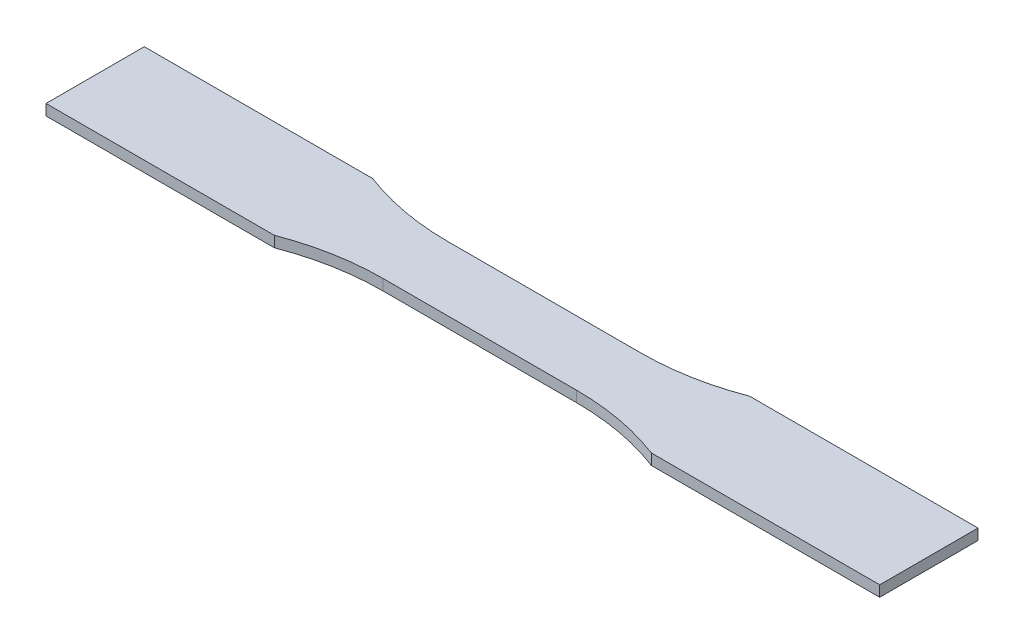
ISO-10303-21;
HEADER;
FILE_DESCRIPTION(('STEP AP214'),'2;1');
FILE_NAME('part.step','',(''),(''),'','','');
FILE_SCHEMA(('AUTOMOTIVE_DESIGN { 1 0 10303 214 1 1 1 1 }'));
ENDSEC;
DATA;
#1=APPLICATION_CONTEXT('core data for automotive mechanical design processes');
#2=APPLICATION_PROTOCOL_DEFINITION('international standard','automotive_design',2000,#1);
#3=PRODUCT_CONTEXT('',#1,'mechanical');
#4=PRODUCT('Part','Part','',(#3));
#5=PRODUCT_RELATED_PRODUCT_CATEGORY('part','',(#4));
#6=PRODUCT_DEFINITION_FORMATION('','',#4);
#7=PRODUCT_DEFINITION_CONTEXT('part definition',#1,'design');
#8=PRODUCT_DEFINITION('design','',#6,#7);
#9=PRODUCT_DEFINITION_SHAPE('','',#8);
#10=(LENGTH_UNIT() NAMED_UNIT(*) SI_UNIT(.MILLI.,.METRE.));
#11=(NAMED_UNIT(*) PLANE_ANGLE_UNIT() SI_UNIT($,.RADIAN.));
#12=(NAMED_UNIT(*) SI_UNIT($,.STERADIAN.) SOLID_ANGLE_UNIT());
#13=UNCERTAINTY_MEASURE_WITH_UNIT(LENGTH_MEASURE(1.E-05),#10,'distance_accuracy_value','');
#14=(GEOMETRIC_REPRESENTATION_CONTEXT(3) GLOBAL_UNCERTAINTY_ASSIGNED_CONTEXT((#13)) GLOBAL_UNIT_ASSIGNED_CONTEXT((#10,
#11,#12)) REPRESENTATION_CONTEXT('',''));
#15=CARTESIAN_POINT('',(0.,0.,0.));
#16=DIRECTION('',(0.,0.,1.));
#17=DIRECTION('',(1.,0.,0.));
#18=AXIS2_PLACEMENT_3D('',#15,#16,#17);
#19=CARTESIAN_POINT('',(-28.4999999999999,1.6,85.5));
#20=DIRECTION('',(0.,-1.,0.));
#21=DIRECTION('',(0.,0.,-1.));
#22=AXIS2_PLACEMENT_3D('',#19,#20,#21);
#23=CYLINDRICAL_SURFACE('',#22,76.);
#24=CARTESIAN_POINT('',(-28.4999999999999,-1.6,85.5));
#25=DIRECTION('',(0.,1.,0.));
#26=DIRECTION('',(0.,0.,1.));
#27=AXIS2_PLACEMENT_3D('',#24,#25,#26);
#28=CIRCLE('',#27,76.);
#29=CARTESIAN_POINT('',(-28.4999999999999,-1.6,9.49999999999999));
#30=VERTEX_POINT('',#29);
#31=CARTESIAN_POINT('',(-55.6108834234518,-1.6,14.5));
#32=VERTEX_POINT('',#31);
#33=EDGE_CURVE('E154',#30,#32,#28,.T.);
#34=ORIENTED_EDGE('',*,*,#33,.F.);
#35=DIRECTION('',(0.,-1.,0.));
#36=VECTOR('',#35,1.);
#37=CARTESIAN_POINT('',(-28.4999999999999,1.6,9.49999999999999));
#38=LINE('',#37,#36);
#39=CARTESIAN_POINT('',(-28.4999999999999,1.6,9.49999999999999));
#40=VERTEX_POINT('',#39);
#41=EDGE_CURVE('E11',#40,#30,#38,.T.);
#42=ORIENTED_EDGE('',*,*,#41,.F.);
#43=CARTESIAN_POINT('',(-28.4999999999999,1.6,85.5));
#44=DIRECTION('',(0.,1.,0.));
#45=DIRECTION('',(0.,0.,1.));
#46=AXIS2_PLACEMENT_3D('',#43,#44,#45);
#47=CIRCLE('',#46,76.);
#48=CARTESIAN_POINT('',(-55.6108834234518,1.6,14.5));
#49=VERTEX_POINT('',#48);
#50=EDGE_CURVE('E185',#40,#49,#47,.T.);
#51=ORIENTED_EDGE('',*,*,#50,.T.);
#52=DIRECTION('',(0.,-1.,0.));
#53=VECTOR('',#52,1.);
#54=CARTESIAN_POINT('',(-55.6108834234518,1.6,14.5));
#55=LINE('',#54,#53);
#56=EDGE_CURVE('E54',#49,#32,#55,.T.);
#57=ORIENTED_EDGE('',*,*,#56,.T.);
#58=EDGE_LOOP('',(#34,#42,#51,#57));
#59=FACE_BOUND('',#58,.T.);
#60=ADVANCED_FACE('F38',(#59),#23,.F.);
#61=CARTESIAN_POINT('',(0.,1.6,9.49999999999999));
#62=DIRECTION('',(0.,0.,1.));
#63=DIRECTION('',(1.,0.,0.));
#64=AXIS2_PLACEMENT_3D('',#61,#62,#63);
#65=PLANE('',#64);
#66=DIRECTION('',(-1.,0.,0.));
#67=VECTOR('',#66,1.);
#68=CARTESIAN_POINT('',(0.,-1.6,9.49999999999999));
#69=LINE('',#68,#67);
#70=CARTESIAN_POINT('',(28.5000000000001,-1.6,9.49999999999999));
#71=VERTEX_POINT('',#70);
#72=EDGE_CURVE('E156',#71,#30,#69,.T.);
#73=ORIENTED_EDGE('',*,*,#72,.F.);
#74=DIRECTION('',(0.,-1.,0.));
#75=VECTOR('',#74,1.);
#76=CARTESIAN_POINT('',(28.5000000000001,1.6,9.49999999999999));
#77=LINE('',#76,#75);
#78=CARTESIAN_POINT('',(28.5000000000001,1.6,9.49999999999999));
#79=VERTEX_POINT('',#78);
#80=EDGE_CURVE('E46',#79,#71,#77,.T.);
#81=ORIENTED_EDGE('',*,*,#80,.F.);
#82=DIRECTION('',(-1.,0.,0.));
#83=VECTOR('',#82,1.);
#84=CARTESIAN_POINT('',(0.,1.6,9.49999999999999));
#85=LINE('',#84,#83);
#86=EDGE_CURVE('E223',#79,#40,#85,.T.);
#87=ORIENTED_EDGE('',*,*,#86,.T.);
#88=ORIENTED_EDGE('',*,*,#41,.T.);
#89=EDGE_LOOP('',(#73,#81,#87,#88));
#90=FACE_BOUND('',#89,.T.);
#91=ADVANCED_FACE('F211',(#90),#65,.T.);
#92=CARTESIAN_POINT('',(28.5000000000001,1.6,85.5));
#93=DIRECTION('',(0.,-1.,0.));
#94=DIRECTION('',(0.,0.,-1.));
#95=AXIS2_PLACEMENT_3D('',#92,#93,#94);
#96=CYLINDRICAL_SURFACE('',#95,76.);
#97=CARTESIAN_POINT('',(28.5000000000001,-1.6,85.5));
#98=DIRECTION('',(0.,1.,0.));
#99=DIRECTION('',(0.,0.,1.));
#100=AXIS2_PLACEMENT_3D('',#97,#98,#99);
#101=CIRCLE('',#100,76.);
#102=CARTESIAN_POINT('',(55.6108834234521,-1.6,14.5));
#103=VERTEX_POINT('',#102);
#104=EDGE_CURVE('E159',#103,#71,#101,.T.);
#105=ORIENTED_EDGE('',*,*,#104,.F.);
#106=DIRECTION('',(0.,-1.,0.));
#107=VECTOR('',#106,1.);
#108=CARTESIAN_POINT('',(55.6108834234521,1.6,14.5));
#109=LINE('',#108,#107);
#110=CARTESIAN_POINT('',(55.6108834234521,1.6,14.5));
#111=VERTEX_POINT('',#110);
#112=EDGE_CURVE('E200',#111,#103,#109,.T.);
#113=ORIENTED_EDGE('',*,*,#112,.F.);
#114=CARTESIAN_POINT('',(28.5000000000001,1.6,85.5));
#115=DIRECTION('',(0.,1.,0.));
#116=DIRECTION('',(0.,0.,1.));
#117=AXIS2_PLACEMENT_3D('',#114,#115,#116);
#118=CIRCLE('',#117,76.);
#119=EDGE_CURVE('E207',#111,#79,#118,.T.);
#120=ORIENTED_EDGE('',*,*,#119,.T.);
#121=ORIENTED_EDGE('',*,*,#80,.T.);
#122=EDGE_LOOP('',(#105,#113,#120,#121));
#123=FACE_BOUND('',#122,.T.);
#124=ADVANCED_FACE('F205',(#123),#96,.F.);
#125=CARTESIAN_POINT('',(0.,1.6,14.5));
#126=DIRECTION('',(0.,0.,1.));
#127=DIRECTION('',(1.,0.,0.));
#128=AXIS2_PLACEMENT_3D('',#125,#126,#127);
#129=PLANE('',#128);
#130=DIRECTION('',(-1.,0.,0.));
#131=VECTOR('',#130,1.);
#132=CARTESIAN_POINT('',(0.,-1.6,14.5));
#133=LINE('',#132,#131);
#134=CARTESIAN_POINT('',(123.,-1.6,14.5));
#135=VERTEX_POINT('',#134);
#136=EDGE_CURVE('E162',#135,#103,#133,.T.);
#137=ORIENTED_EDGE('',*,*,#136,.F.);
#138=DIRECTION('',(0.,-1.,0.));
#139=VECTOR('',#138,1.);
#140=CARTESIAN_POINT('',(123.,1.6,14.5));
#141=LINE('',#140,#139);
#142=CARTESIAN_POINT('',(123.,1.6,14.5));
#143=VERTEX_POINT('',#142);
#144=EDGE_CURVE('E198',#143,#135,#141,.T.);
#145=ORIENTED_EDGE('',*,*,#144,.F.);
#146=DIRECTION('',(-1.,0.,0.));
#147=VECTOR('',#146,1.);
#148=CARTESIAN_POINT('',(0.,1.6,14.5));
#149=LINE('',#148,#147);
#150=EDGE_CURVE('E222',#143,#111,#149,.T.);
#151=ORIENTED_EDGE('',*,*,#150,.T.);
#152=ORIENTED_EDGE('',*,*,#112,.T.);
#153=EDGE_LOOP('',(#137,#145,#151,#152));
#154=FACE_BOUND('',#153,.T.);
#155=ADVANCED_FACE('F218',(#154),#129,.T.);
#156=CARTESIAN_POINT('',(123.,1.6,0.));
#157=DIRECTION('',(-1.,0.,0.));
#158=DIRECTION('',(0.,0.,1.));
#159=AXIS2_PLACEMENT_3D('',#156,#157,#158);
#160=PLANE('',#159);
#161=DIRECTION('',(0.,0.,-1.));
#162=VECTOR('',#161,1.);
#163=CARTESIAN_POINT('',(123.,-1.6,0.));
#164=LINE('',#163,#162);
#165=CARTESIAN_POINT('',(123.,-1.6,-14.5));
#166=VERTEX_POINT('',#165);
#167=EDGE_CURVE('E165',#135,#166,#164,.T.);
#168=ORIENTED_EDGE('',*,*,#167,.T.);
#169=DIRECTION('',(0.,-1.,0.));
#170=VECTOR('',#169,1.);
#171=CARTESIAN_POINT('',(123.,1.6,-14.5));
#172=LINE('',#171,#170);
#173=CARTESIAN_POINT('',(123.,1.6,-14.5));
#174=VERTEX_POINT('',#173);
#175=EDGE_CURVE('E195',#174,#166,#172,.T.);
#176=ORIENTED_EDGE('',*,*,#175,.F.);
#177=DIRECTION('',(0.,0.,-1.));
#178=VECTOR('',#177,1.);
#179=CARTESIAN_POINT('',(123.,1.6,0.));
#180=LINE('',#179,#178);
#181=EDGE_CURVE('E225',#143,#174,#180,.T.);
#182=ORIENTED_EDGE('',*,*,#181,.F.);
#183=ORIENTED_EDGE('',*,*,#144,.T.);
#184=EDGE_LOOP('',(#168,#176,#182,#183));
#185=FACE_BOUND('',#184,.T.);
#186=ADVANCED_FACE('F263',(#185),#160,.F.);
#187=CARTESIAN_POINT('',(0.,1.6,-14.5));
#188=DIRECTION('',(0.,0.,1.));
#189=DIRECTION('',(1.,0.,0.));
#190=AXIS2_PLACEMENT_3D('',#187,#188,#189);
#191=PLANE('',#190);
#192=DIRECTION('',(-1.,0.,0.));
#193=VECTOR('',#192,1.);
#194=CARTESIAN_POINT('',(0.,-1.6,-14.5));
#195=LINE('',#194,#193);
#196=CARTESIAN_POINT('',(55.6108834234521,-1.6,-14.5));
#197=VERTEX_POINT('',#196);
#198=EDGE_CURVE('E167',#166,#197,#195,.T.);
#199=ORIENTED_EDGE('',*,*,#198,.T.);
#200=DIRECTION('',(0.,-1.,0.));
#201=VECTOR('',#200,1.);
#202=CARTESIAN_POINT('',(55.6108834234521,1.6,-14.5));
#203=LINE('',#202,#201);
#204=CARTESIAN_POINT('',(55.6108834234521,1.6,-14.5));
#205=VERTEX_POINT('',#204);
#206=EDGE_CURVE('E193',#205,#197,#203,.T.);
#207=ORIENTED_EDGE('',*,*,#206,.F.);
#208=DIRECTION('',(-1.,0.,0.));
#209=VECTOR('',#208,1.);
#210=CARTESIAN_POINT('',(0.,1.6,-14.5));
#211=LINE('',#210,#209);
#212=EDGE_CURVE('E231',#174,#205,#211,.T.);
#213=ORIENTED_EDGE('',*,*,#212,.F.);
#214=ORIENTED_EDGE('',*,*,#175,.T.);
#215=EDGE_LOOP('',(#199,#207,#213,#214));
#216=FACE_BOUND('',#215,.T.);
#217=ADVANCED_FACE('F266',(#216),#191,.F.);
#218=CARTESIAN_POINT('',(28.5000000000001,1.6,-85.5));
#219=DIRECTION('',(0.,-1.,0.));
#220=DIRECTION('',(0.,0.,-1.));
#221=AXIS2_PLACEMENT_3D('',#218,#219,#220);
#222=CYLINDRICAL_SURFACE('',#221,76.);
#223=CARTESIAN_POINT('',(28.5000000000001,-1.6,-85.5));
#224=DIRECTION('',(0.,1.,0.));
#225=DIRECTION('',(0.,0.,1.));
#226=AXIS2_PLACEMENT_3D('',#223,#224,#225);
#227=CIRCLE('',#226,76.);
#228=CARTESIAN_POINT('',(28.5000000000001,-1.6,-9.50000000000001));
#229=VERTEX_POINT('',#228);
#230=EDGE_CURVE('E170',#229,#197,#227,.T.);
#231=ORIENTED_EDGE('',*,*,#230,.F.);
#232=DIRECTION('',(0.,-1.,0.));
#233=VECTOR('',#232,1.);
#234=CARTESIAN_POINT('',(28.5000000000001,1.6,-9.50000000000001));
#235=LINE('',#234,#233);
#236=CARTESIAN_POINT('',(28.5000000000001,1.6,-9.50000000000001));
#237=VERTEX_POINT('',#236);
#238=EDGE_CURVE('E191',#237,#229,#235,.T.);
#239=ORIENTED_EDGE('',*,*,#238,.F.);
#240=CARTESIAN_POINT('',(28.5000000000001,1.6,-85.5));
#241=DIRECTION('',(0.,1.,0.));
#242=DIRECTION('',(0.,0.,1.));
#243=AXIS2_PLACEMENT_3D('',#240,#241,#242);
#244=CIRCLE('',#243,76.);
#245=EDGE_CURVE('E233',#237,#205,#244,.T.);
#246=ORIENTED_EDGE('',*,*,#245,.T.);
#247=ORIENTED_EDGE('',*,*,#206,.T.);
#248=EDGE_LOOP('',(#231,#239,#246,#247));
#249=FACE_BOUND('',#248,.T.);
#250=ADVANCED_FACE('F270',(#249),#222,.F.);
#251=CARTESIAN_POINT('',(0.,1.6,-9.50000000000001));
#252=DIRECTION('',(0.,0.,1.));
#253=DIRECTION('',(1.,0.,0.));
#254=AXIS2_PLACEMENT_3D('',#251,#252,#253);
#255=PLANE('',#254);
#256=DIRECTION('',(-1.,0.,0.));
#257=VECTOR('',#256,1.);
#258=CARTESIAN_POINT('',(0.,-1.6,-9.50000000000001));
#259=LINE('',#258,#257);
#260=CARTESIAN_POINT('',(-28.4999999999999,-1.6,-9.50000000000001));
#261=VERTEX_POINT('',#260);
#262=EDGE_CURVE('E173',#229,#261,#259,.T.);
#263=ORIENTED_EDGE('',*,*,#262,.T.);
#264=DIRECTION('',(0.,-1.,0.));
#265=VECTOR('',#264,1.);
#266=CARTESIAN_POINT('',(-28.4999999999999,1.6,-9.50000000000001));
#267=LINE('',#266,#265);
#268=CARTESIAN_POINT('',(-28.4999999999999,1.6,-9.50000000000001));
#269=VERTEX_POINT('',#268);
#270=EDGE_CURVE('E189',#269,#261,#267,.T.);
#271=ORIENTED_EDGE('',*,*,#270,.F.);
#272=DIRECTION('',(-1.,0.,0.));
#273=VECTOR('',#272,1.);
#274=CARTESIAN_POINT('',(0.,1.6,-9.50000000000001));
#275=LINE('',#274,#273);
#276=EDGE_CURVE('E236',#237,#269,#275,.T.);
#277=ORIENTED_EDGE('',*,*,#276,.F.);
#278=ORIENTED_EDGE('',*,*,#238,.T.);
#279=EDGE_LOOP('',(#263,#271,#277,#278));
#280=FACE_BOUND('',#279,.T.);
#281=ADVANCED_FACE('F274',(#280),#255,.F.);
#282=CARTESIAN_POINT('',(-28.4999999999999,1.6,-85.5));
#283=DIRECTION('',(0.,-1.,0.));
#284=DIRECTION('',(0.,0.,-1.));
#285=AXIS2_PLACEMENT_3D('',#282,#283,#284);
#286=CYLINDRICAL_SURFACE('',#285,76.);
#287=CARTESIAN_POINT('',(-28.4999999999999,-1.6,-85.5));
#288=DIRECTION('',(0.,1.,0.));
#289=DIRECTION('',(0.,0.,1.));
#290=AXIS2_PLACEMENT_3D('',#287,#288,#289);
#291=CIRCLE('',#290,76.);
#292=CARTESIAN_POINT('',(-55.6108834234518,-1.6,-14.5));
#293=VERTEX_POINT('',#292);
#294=EDGE_CURVE('E176',#293,#261,#291,.T.);
#295=ORIENTED_EDGE('',*,*,#294,.F.);
#296=DIRECTION('',(0.,-1.,0.));
#297=VECTOR('',#296,1.);
#298=CARTESIAN_POINT('',(-55.6108834234518,1.6,-14.5));
#299=LINE('',#298,#297);
#300=CARTESIAN_POINT('',(-55.6108834234518,1.6,-14.5));
#301=VERTEX_POINT('',#300);
#302=EDGE_CURVE('E146',#301,#293,#299,.T.);
#303=ORIENTED_EDGE('',*,*,#302,.F.);
#304=CARTESIAN_POINT('',(-28.4999999999999,1.6,-85.5));
#305=DIRECTION('',(0.,1.,0.));
#306=DIRECTION('',(0.,0.,1.));
#307=AXIS2_PLACEMENT_3D('',#304,#305,#306);
#308=CIRCLE('',#307,76.);
#309=EDGE_CURVE('E136',#301,#269,#308,.T.);
#310=ORIENTED_EDGE('',*,*,#309,.T.);
#311=ORIENTED_EDGE('',*,*,#270,.T.);
#312=EDGE_LOOP('',(#295,#303,#310,#311));
#313=FACE_BOUND('',#312,.T.);
#314=ADVANCED_FACE('F239',(#313),#286,.F.);
#315=CARTESIAN_POINT('',(0.,1.6,-14.5));
#316=DIRECTION('',(0.,0.,1.));
#317=DIRECTION('',(1.,0.,0.));
#318=AXIS2_PLACEMENT_3D('',#315,#316,#317);
#319=PLANE('',#318);
#320=DIRECTION('',(-1.,0.,0.));
#321=VECTOR('',#320,1.);
#322=CARTESIAN_POINT('',(0.,-1.6,-14.5));
#323=LINE('',#322,#321);
#324=CARTESIAN_POINT('',(-123.,-1.6,-14.5));
#325=VERTEX_POINT('',#324);
#326=EDGE_CURVE('E143',#293,#325,#323,.T.);
#327=ORIENTED_EDGE('',*,*,#326,.T.);
#328=DIRECTION('',(0.,-1.,0.));
#329=VECTOR('',#328,1.);
#330=CARTESIAN_POINT('',(-123.,1.6,-14.5));
#331=LINE('',#330,#329);
#332=CARTESIAN_POINT('',(-123.,1.6,-14.5));
#333=VERTEX_POINT('',#332);
#334=EDGE_CURVE('E140',#333,#325,#331,.T.);
#335=ORIENTED_EDGE('',*,*,#334,.F.);
#336=DIRECTION('',(-1.,0.,0.));
#337=VECTOR('',#336,1.);
#338=CARTESIAN_POINT('',(0.,1.6,-14.5));
#339=LINE('',#338,#337);
#340=EDGE_CURVE('E129',#301,#333,#339,.T.);
#341=ORIENTED_EDGE('',*,*,#340,.F.);
#342=ORIENTED_EDGE('',*,*,#302,.T.);
#343=EDGE_LOOP('',(#327,#335,#341,#342));
#344=FACE_BOUND('',#343,.T.);
#345=ADVANCED_FACE('F141',(#344),#319,.F.);
#346=CARTESIAN_POINT('',(-123.,1.6,0.));
#347=DIRECTION('',(-1.,0.,0.));
#348=DIRECTION('',(0.,0.,1.));
#349=AXIS2_PLACEMENT_3D('',#346,#347,#348);
#350=PLANE('',#349);
#351=DIRECTION('',(0.,0.,-1.));
#352=VECTOR('',#351,1.);
#353=CARTESIAN_POINT('',(-123.,-1.6,0.));
#354=LINE('',#353,#352);
#355=CARTESIAN_POINT('',(-123.,-1.6,14.5));
#356=VERTEX_POINT('',#355);
#357=EDGE_CURVE('E180',#356,#325,#354,.T.);
#358=ORIENTED_EDGE('',*,*,#357,.F.);
#359=DIRECTION('',(0.,-1.,0.));
#360=VECTOR('',#359,1.);
#361=CARTESIAN_POINT('',(-123.,1.6,14.5));
#362=LINE('',#361,#360);
#363=CARTESIAN_POINT('',(-123.,1.6,14.5));
#364=VERTEX_POINT('',#363);
#365=EDGE_CURVE('E91',#364,#356,#362,.T.);
#366=ORIENTED_EDGE('',*,*,#365,.F.);
#367=DIRECTION('',(0.,0.,-1.));
#368=VECTOR('',#367,1.);
#369=CARTESIAN_POINT('',(-123.,1.6,0.));
#370=LINE('',#369,#368);
#371=EDGE_CURVE('E134',#364,#333,#370,.T.);
#372=ORIENTED_EDGE('',*,*,#371,.T.);
#373=ORIENTED_EDGE('',*,*,#334,.T.);
#374=EDGE_LOOP('',(#358,#366,#372,#373));
#375=FACE_BOUND('',#374,.T.);
#376=ADVANCED_FACE('F148',(#375),#350,.T.);
#377=CARTESIAN_POINT('',(0.,1.6,14.5));
#378=DIRECTION('',(0.,0.,1.));
#379=DIRECTION('',(1.,0.,0.));
#380=AXIS2_PLACEMENT_3D('',#377,#378,#379);
#381=PLANE('',#380);
#382=DIRECTION('',(-1.,0.,0.));
#383=VECTOR('',#382,1.);
#384=CARTESIAN_POINT('',(0.,-1.6,14.5));
#385=LINE('',#384,#383);
#386=EDGE_CURVE('E182',#32,#356,#385,.T.);
#387=ORIENTED_EDGE('',*,*,#386,.F.);
#388=ORIENTED_EDGE('',*,*,#56,.F.);
#389=DIRECTION('',(-1.,0.,0.));
#390=VECTOR('',#389,1.);
#391=CARTESIAN_POINT('',(0.,1.6,14.5));
#392=LINE('',#391,#390);
#393=EDGE_CURVE('E149',#49,#364,#392,.T.);
#394=ORIENTED_EDGE('',*,*,#393,.T.);
#395=ORIENTED_EDGE('',*,*,#365,.T.);
#396=EDGE_LOOP('',(#387,#388,#394,#395));
#397=FACE_BOUND('',#396,.T.);
#398=ADVANCED_FACE('F242',(#397),#381,.T.);
#399=CARTESIAN_POINT('',(0.,1.6,0.));
#400=DIRECTION('',(0.,1.,0.));
#401=DIRECTION('',(0.,0.,1.));
#402=AXIS2_PLACEMENT_3D('',#399,#400,#401);
#403=PLANE('',#402);
#404=ORIENTED_EDGE('',*,*,#50,.F.);
#405=ORIENTED_EDGE('',*,*,#86,.F.);
#406=ORIENTED_EDGE('',*,*,#119,.F.);
#407=ORIENTED_EDGE('',*,*,#150,.F.);
#408=ORIENTED_EDGE('',*,*,#181,.T.);
#409=ORIENTED_EDGE('',*,*,#212,.T.);
#410=ORIENTED_EDGE('',*,*,#245,.F.);
#411=ORIENTED_EDGE('',*,*,#276,.T.);
#412=ORIENTED_EDGE('',*,*,#309,.F.);
#413=ORIENTED_EDGE('',*,*,#340,.T.);
#414=ORIENTED_EDGE('',*,*,#371,.F.);
#415=ORIENTED_EDGE('',*,*,#393,.F.);
#416=EDGE_LOOP('',(#404,#405,#406,#407,#408,#409,#410,#411,#412,#413,#414,#415));
#417=FACE_BOUND('',#416,.T.);
#418=ADVANCED_FACE('F131',(#417),#403,.T.);
#419=CARTESIAN_POINT('',(0.,-1.6,0.));
#420=DIRECTION('',(0.,1.,0.));
#421=DIRECTION('',(0.,0.,1.));
#422=AXIS2_PLACEMENT_3D('',#419,#420,#421);
#423=PLANE('',#422);
#424=ORIENTED_EDGE('',*,*,#33,.T.);
#425=ORIENTED_EDGE('',*,*,#386,.T.);
#426=ORIENTED_EDGE('',*,*,#357,.T.);
#427=ORIENTED_EDGE('',*,*,#326,.F.);
#428=ORIENTED_EDGE('',*,*,#294,.T.);
#429=ORIENTED_EDGE('',*,*,#262,.F.);
#430=ORIENTED_EDGE('',*,*,#230,.T.);
#431=ORIENTED_EDGE('',*,*,#198,.F.);
#432=ORIENTED_EDGE('',*,*,#167,.F.);
#433=ORIENTED_EDGE('',*,*,#136,.T.);
#434=ORIENTED_EDGE('',*,*,#104,.T.);
#435=ORIENTED_EDGE('',*,*,#72,.T.);
#436=EDGE_LOOP('',(#424,#425,#426,#427,#428,#429,#430,#431,#432,#433,#434,#435));
#437=FACE_BOUND('',#436,.T.);
#438=ADVANCED_FACE('F213',(#437),#423,.F.);
#439=CLOSED_SHELL('',(#60,#91,#124,#155,#186,#217,#250,#281,#314,#345,#376,#398,#418,#438));
#440=MANIFOLD_SOLID_BREP('B2',#439);
#441=ADVANCED_BREP_SHAPE_REPRESENTATION('',(#18,#440),#14);
#442=SHAPE_DEFINITION_REPRESENTATION(#9,#441);
ENDSEC;
END-ISO-10303-21;
